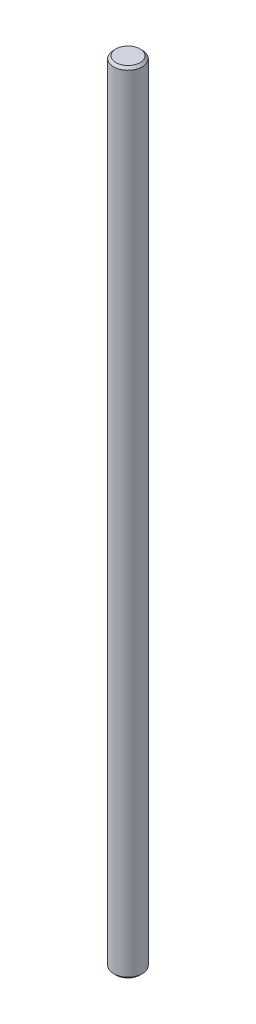
ISO-10303-21;
HEADER;
FILE_DESCRIPTION(('STEP AP214'),'2;1');
FILE_NAME('part.step','',(''),(''),'','','');
FILE_SCHEMA(('AUTOMOTIVE_DESIGN { 1 0 10303 214 1 1 1 1 }'));
ENDSEC;
DATA;
#1=APPLICATION_CONTEXT('core data for automotive mechanical design processes');
#2=APPLICATION_PROTOCOL_DEFINITION('international standard','automotive_design',2000,#1);
#3=PRODUCT_CONTEXT('',#1,'mechanical');
#4=PRODUCT('Part','Part','',(#3));
#5=PRODUCT_RELATED_PRODUCT_CATEGORY('part','',(#4));
#6=PRODUCT_DEFINITION_FORMATION('','',#4);
#7=PRODUCT_DEFINITION_CONTEXT('part definition',#1,'design');
#8=PRODUCT_DEFINITION('design','',#6,#7);
#9=PRODUCT_DEFINITION_SHAPE('','',#8);
#10=(LENGTH_UNIT() NAMED_UNIT(*) SI_UNIT(.MILLI.,.METRE.));
#11=(NAMED_UNIT(*) PLANE_ANGLE_UNIT() SI_UNIT($,.RADIAN.));
#12=(NAMED_UNIT(*) SI_UNIT($,.STERADIAN.) SOLID_ANGLE_UNIT());
#13=UNCERTAINTY_MEASURE_WITH_UNIT(LENGTH_MEASURE(1.E-05),#10,'distance_accuracy_value','');
#14=(GEOMETRIC_REPRESENTATION_CONTEXT(3) GLOBAL_UNCERTAINTY_ASSIGNED_CONTEXT((#13)) GLOBAL_UNIT_ASSIGNED_CONTEXT((#10,
#11,#12)) REPRESENTATION_CONTEXT('',''));
#15=CARTESIAN_POINT('',(0.,0.,0.));
#16=DIRECTION('',(0.,0.,1.));
#17=DIRECTION('',(1.,0.,0.));
#18=AXIS2_PLACEMENT_3D('',#15,#16,#17);
#19=CARTESIAN_POINT('',(0.,330.,-0.0104188651304302));
#20=DIRECTION('',(0.,-1.,0.));
#21=DIRECTION('',(0.,0.,-1.));
#22=AXIS2_PLACEMENT_3D('',#19,#20,#21);
#23=CYLINDRICAL_SURFACE('',#22,6.);
#24=CARTESIAN_POINT('',(0.,329.,-0.0104188651304302));
#25=DIRECTION('',(0.,1.,0.));
#26=DIRECTION('',(0.,0.,1.));
#27=AXIS2_PLACEMENT_3D('',#24,#25,#26);
#28=CIRCLE('',#27,6.);
#29=CARTESIAN_POINT('',(0.,329.,5.98958113486957));
#30=VERTEX_POINT('',#29);
#31=EDGE_CURVE('E39',#30,#30,#28,.F.);
#32=ORIENTED_EDGE('',*,*,#31,.T.);
#33=EDGE_LOOP('',(#32));
#34=FACE_BOUND('',#33,.T.);
#35=CARTESIAN_POINT('',(0.,0.999999999999945,-0.0104188651304302));
#36=DIRECTION('',(0.,1.,0.));
#37=DIRECTION('',(0.,0.,1.));
#38=AXIS2_PLACEMENT_3D('',#35,#36,#37);
#39=CIRCLE('',#38,6.);
#40=CARTESIAN_POINT('',(0.,0.999999999999945,5.98958113486957));
#41=VERTEX_POINT('',#40);
#42=EDGE_CURVE('E43',#41,#41,#39,.T.);
#43=ORIENTED_EDGE('',*,*,#42,.T.);
#44=EDGE_LOOP('',(#43));
#45=FACE_BOUND('',#44,.T.);
#46=ADVANCED_FACE('F32',(#34,#45),#23,.T.);
#47=CARTESIAN_POINT('',(0.,330.,-0.0104188651304302));
#48=DIRECTION('',(0.,1.,0.));
#49=DIRECTION('',(0.,0.,1.));
#50=AXIS2_PLACEMENT_3D('',#47,#48,#49);
#51=PLANE('',#50);
#52=CARTESIAN_POINT('',(0.,330.,-0.0104188651304302));
#53=DIRECTION('',(0.,1.,0.));
#54=DIRECTION('',(0.,0.,1.));
#55=AXIS2_PLACEMENT_3D('',#52,#53,#54);
#56=CIRCLE('',#55,5.00000000000003);
#57=CARTESIAN_POINT('',(0.,330.,4.9895811348696));
#58=VERTEX_POINT('',#57);
#59=EDGE_CURVE('E47',#58,#58,#56,.T.);
#60=ORIENTED_EDGE('',*,*,#59,.T.);
#61=EDGE_LOOP('',(#60));
#62=FACE_BOUND('',#61,.T.);
#63=ADVANCED_FACE('F53',(#62),#51,.T.);
#64=CARTESIAN_POINT('',(0.,0.,-0.0104188651304302));
#65=DIRECTION('',(0.,1.,0.));
#66=DIRECTION('',(0.,0.,1.));
#67=AXIS2_PLACEMENT_3D('',#64,#65,#66);
#68=PLANE('',#67);
#69=CARTESIAN_POINT('',(0.,0.,-0.0104188651304302));
#70=DIRECTION('',(0.,1.,0.));
#71=DIRECTION('',(0.,0.,1.));
#72=AXIS2_PLACEMENT_3D('',#69,#70,#71);
#73=CIRCLE('',#72,5.00000000000006);
#74=CARTESIAN_POINT('',(0.,0.,4.98958113486963));
#75=VERTEX_POINT('',#74);
#76=EDGE_CURVE('E10',#75,#75,#73,.F.);
#77=ORIENTED_EDGE('',*,*,#76,.T.);
#78=EDGE_LOOP('',(#77));
#79=FACE_BOUND('',#78,.T.);
#80=ADVANCED_FACE('F57',(#79),#68,.F.);
#81=CARTESIAN_POINT('',(0.,330.,-0.0104188651304302));
#82=DIRECTION('',(0.,-1.,0.));
#83=DIRECTION('',(0.,0.,-1.));
#84=AXIS2_PLACEMENT_3D('',#81,#82,#83);
#85=CONICAL_SURFACE('',#84,5.00000000000003,0.78539816339746);
#86=ORIENTED_EDGE('',*,*,#31,.F.);
#87=EDGE_LOOP('',(#86));
#88=FACE_BOUND('',#87,.T.);
#89=ORIENTED_EDGE('',*,*,#59,.F.);
#90=EDGE_LOOP('',(#89));
#91=FACE_BOUND('',#90,.T.);
#92=ADVANCED_FACE('F55',(#88,#91),#85,.T.);
#93=CARTESIAN_POINT('',(0.,0.999999999999945,-0.0104188651304302));
#94=DIRECTION('',(0.,1.,0.));
#95=DIRECTION('',(0.,0.,1.));
#96=AXIS2_PLACEMENT_3D('',#93,#94,#95);
#97=CONICAL_SURFACE('',#96,6.,0.785398163397446);
#98=ORIENTED_EDGE('',*,*,#76,.F.);
#99=EDGE_LOOP('',(#98));
#100=FACE_BOUND('',#99,.T.);
#101=ORIENTED_EDGE('',*,*,#42,.F.);
#102=EDGE_LOOP('',(#101));
#103=FACE_BOUND('',#102,.T.);
#104=ADVANCED_FACE('F34',(#100,#103),#97,.T.);
#105=CLOSED_SHELL('',(#46,#63,#80,#92,#104));
#106=MANIFOLD_SOLID_BREP('B2',#105);
#107=ADVANCED_BREP_SHAPE_REPRESENTATION('',(#18,#106),#14);
#108=SHAPE_DEFINITION_REPRESENTATION(#9,#107);
ENDSEC;
END-ISO-10303-21;
